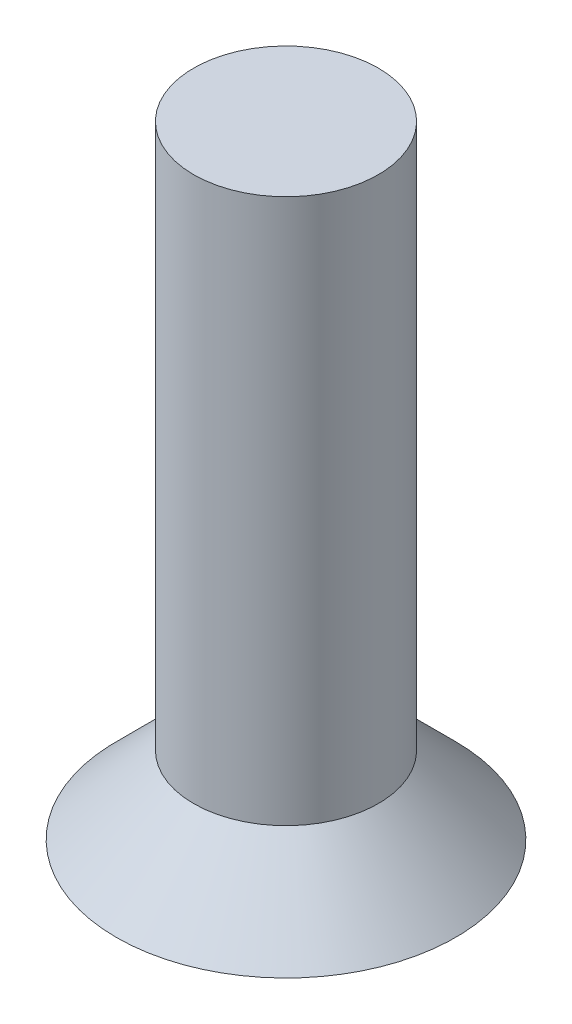
ISO-10303-21;
HEADER;
FILE_DESCRIPTION(('STEP AP214'),'2;1');
FILE_NAME('part.step','',(''),(''),'','','');
FILE_SCHEMA(('AUTOMOTIVE_DESIGN { 1 0 10303 214 1 1 1 1 }'));
ENDSEC;
DATA;
#1=APPLICATION_CONTEXT('core data for automotive mechanical design processes');
#2=APPLICATION_PROTOCOL_DEFINITION('international standard','automotive_design',2000,#1);
#3=PRODUCT_CONTEXT('',#1,'mechanical');
#4=PRODUCT('Part','Part','',(#3));
#5=PRODUCT_RELATED_PRODUCT_CATEGORY('part','',(#4));
#6=PRODUCT_DEFINITION_FORMATION('','',#4);
#7=PRODUCT_DEFINITION_CONTEXT('part definition',#1,'design');
#8=PRODUCT_DEFINITION('design','',#6,#7);
#9=PRODUCT_DEFINITION_SHAPE('','',#8);
#10=(LENGTH_UNIT() NAMED_UNIT(*) SI_UNIT(.MILLI.,.METRE.));
#11=(NAMED_UNIT(*) PLANE_ANGLE_UNIT() SI_UNIT($,.RADIAN.));
#12=(NAMED_UNIT(*) SI_UNIT($,.STERADIAN.) SOLID_ANGLE_UNIT());
#13=UNCERTAINTY_MEASURE_WITH_UNIT(LENGTH_MEASURE(1.E-05),#10,'distance_accuracy_value','');
#14=(GEOMETRIC_REPRESENTATION_CONTEXT(3) GLOBAL_UNCERTAINTY_ASSIGNED_CONTEXT((#13)) GLOBAL_UNIT_ASSIGNED_CONTEXT((#10,
#11,#12)) REPRESENTATION_CONTEXT('',''));
#15=CARTESIAN_POINT('',(0.,0.,0.));
#16=DIRECTION('',(0.,0.,1.));
#17=DIRECTION('',(1.,0.,0.));
#18=AXIS2_PLACEMENT_3D('',#15,#16,#17);
#19=CARTESIAN_POINT('',(0.,0.,0.));
#20=DIRECTION('',(0.,1.,0.));
#21=DIRECTION('',(0.,0.,1.));
#22=AXIS2_PLACEMENT_3D('',#19,#20,#21);
#23=PLANE('',#22);
#24=DIRECTION('',(0.866025403784438,0.,0.500000000000001));
#25=VECTOR('',#24,1.);
#26=CARTESIAN_POINT('',(0.,0.,-1.66247090152183));
#27=LINE('',#26,#25);
#28=CARTESIAN_POINT('',(0.,0.,-1.66247090152183));
#29=VERTEX_POINT('',#28);
#30=CARTESIAN_POINT('',(1.43974203377032,0.,-0.831235450760911));
#31=VERTEX_POINT('',#30);
#32=EDGE_CURVE('E128',#29,#31,#27,.T.);
#33=ORIENTED_EDGE('',*,*,#32,.F.);
#34=DIRECTION('',(0.866025403784441,0.,-0.499999999999995));
#35=VECTOR('',#34,1.);
#36=CARTESIAN_POINT('',(-1.43974203377031,0.,-0.831235450760931));
#37=LINE('',#36,#35);
#38=CARTESIAN_POINT('',(-1.43974203377031,0.,-0.831235450760931));
#39=VERTEX_POINT('',#38);
#40=EDGE_CURVE('E54',#39,#29,#37,.T.);
#41=ORIENTED_EDGE('',*,*,#40,.F.);
#42=DIRECTION('',(0.,0.,-1.));
#43=VECTOR('',#42,1.);
#44=CARTESIAN_POINT('',(-1.43974203377033,0.,0.831235450760901));
#45=LINE('',#44,#43);
#46=CARTESIAN_POINT('',(-1.43974203377033,0.,0.831235450760901));
#47=VERTEX_POINT('',#46);
#48=EDGE_CURVE('E137',#47,#39,#45,.T.);
#49=ORIENTED_EDGE('',*,*,#48,.F.);
#50=DIRECTION('',(-0.866025403784434,0.,-0.500000000000007));
#51=VECTOR('',#50,1.);
#52=CARTESIAN_POINT('',(0.,0.,1.66247090152183));
#53=LINE('',#52,#51);
#54=CARTESIAN_POINT('',(0.,0.,1.66247090152183));
#55=VERTEX_POINT('',#54);
#56=EDGE_CURVE('E135',#55,#47,#53,.T.);
#57=ORIENTED_EDGE('',*,*,#56,.F.);
#58=DIRECTION('',(-0.866025403784442,0.,0.499999999999995));
#59=VECTOR('',#58,1.);
#60=CARTESIAN_POINT('',(1.43974203377032,0.,0.831235450760921));
#61=LINE('',#60,#59);
#62=CARTESIAN_POINT('',(1.43974203377032,0.,0.831235450760921));
#63=VERTEX_POINT('',#62);
#64=EDGE_CURVE('E102',#63,#55,#61,.T.);
#65=ORIENTED_EDGE('',*,*,#64,.F.);
#66=DIRECTION('',(0.,0.,1.));
#67=VECTOR('',#66,1.);
#68=CARTESIAN_POINT('',(1.43974203377032,0.,-0.831235450760911));
#69=LINE('',#68,#67);
#70=EDGE_CURVE('E131',#31,#63,#69,.T.);
#71=ORIENTED_EDGE('',*,*,#70,.F.);
#72=EDGE_LOOP('',(#33,#41,#49,#57,#65,#71));
#73=FACE_BOUND('',#72,.T.);
#74=CARTESIAN_POINT('',(0.,0.,0.));
#75=DIRECTION('',(0.,1.,0.));
#76=DIRECTION('',(0.,0.,1.));
#77=AXIS2_PLACEMENT_3D('',#74,#75,#76);
#78=CIRCLE('',#77,4.5);
#79=CARTESIAN_POINT('',(0.,0.,4.5));
#80=VERTEX_POINT('',#79);
#81=EDGE_CURVE('E47',#80,#80,#78,.T.);
#82=ORIENTED_EDGE('',*,*,#81,.F.);
#83=EDGE_LOOP('',(#82));
#84=FACE_BOUND('',#83,.T.);
#85=ADVANCED_FACE('F38',(#73,#84),#23,.F.);
#86=CARTESIAN_POINT('',(0.,16.5,0.));
#87=DIRECTION('',(0.,-1.,0.));
#88=DIRECTION('',(0.,0.,-1.));
#89=AXIS2_PLACEMENT_3D('',#86,#87,#88);
#90=CYLINDRICAL_SURFACE('',#89,2.45);
#91=CARTESIAN_POINT('',(0.,2.04999999999996,0.));
#92=DIRECTION('',(0.,-1.,0.));
#93=DIRECTION('',(0.,0.,-1.));
#94=AXIS2_PLACEMENT_3D('',#91,#92,#93);
#95=CIRCLE('',#94,2.45);
#96=CARTESIAN_POINT('',(0.,2.04999999999996,-2.45));
#97=VERTEX_POINT('',#96);
#98=EDGE_CURVE('E11',#97,#97,#95,.F.);
#99=ORIENTED_EDGE('',*,*,#98,.T.);
#100=EDGE_LOOP('',(#99));
#101=FACE_BOUND('',#100,.T.);
#102=CARTESIAN_POINT('',(0.,16.5,0.));
#103=DIRECTION('',(0.,1.,0.));
#104=DIRECTION('',(0.,0.,1.));
#105=AXIS2_PLACEMENT_3D('',#102,#103,#104);
#106=CIRCLE('',#105,2.45);
#107=CARTESIAN_POINT('',(0.,16.5,2.45));
#108=VERTEX_POINT('',#107);
#109=EDGE_CURVE('E141',#108,#108,#106,.T.);
#110=ORIENTED_EDGE('',*,*,#109,.F.);
#111=EDGE_LOOP('',(#110));
#112=FACE_BOUND('',#111,.T.);
#113=ADVANCED_FACE('F154',(#101,#112),#90,.T.);
#114=CARTESIAN_POINT('',(0.,16.5,0.));
#115=DIRECTION('',(0.,1.,0.));
#116=DIRECTION('',(0.,0.,1.));
#117=AXIS2_PLACEMENT_3D('',#114,#115,#116);
#118=PLANE('',#117);
#119=ORIENTED_EDGE('',*,*,#109,.T.);
#120=EDGE_LOOP('',(#119));
#121=FACE_BOUND('',#120,.T.);
#122=ADVANCED_FACE('F159',(#121),#118,.T.);
#123=CARTESIAN_POINT('',(0.,2.5,0.));
#124=DIRECTION('',(0.,-1.,0.));
#125=DIRECTION('',(0.,0.,-1.));
#126=AXIS2_PLACEMENT_3D('',#123,#124,#125);
#127=CONICAL_SURFACE('',#126,1.99999999999996,0.785398163397453);
#128=ORIENTED_EDGE('',*,*,#81,.T.);
#129=EDGE_LOOP('',(#128));
#130=FACE_BOUND('',#129,.T.);
#131=ORIENTED_EDGE('',*,*,#98,.F.);
#132=EDGE_LOOP('',(#131));
#133=FACE_BOUND('',#132,.T.);
#134=ADVANCED_FACE('F41',(#130,#133),#127,.T.);
#135=CARTESIAN_POINT('',(-1.43974203377031,1.5,-0.831235450760931));
#136=DIRECTION('',(-0.499999999999995,0.,-0.866025403784441));
#137=DIRECTION('',(-0.866025403784441,0.,0.499999999999995));
#138=AXIS2_PLACEMENT_3D('',#135,#136,#137);
#139=PLANE('',#138);
#140=ORIENTED_EDGE('',*,*,#40,.T.);
#141=DIRECTION('',(0.,-1.,0.));
#142=VECTOR('',#141,1.);
#143=CARTESIAN_POINT('',(0.,1.5,-1.66247090152183));
#144=LINE('',#143,#142);
#145=CARTESIAN_POINT('',(0.,1.5,-1.66247090152183));
#146=VERTEX_POINT('',#145);
#147=EDGE_CURVE('E84',#146,#29,#144,.T.);
#148=ORIENTED_EDGE('',*,*,#147,.F.);
#149=DIRECTION('',(0.866025403784441,0.,-0.499999999999995));
#150=VECTOR('',#149,1.);
#151=CARTESIAN_POINT('',(-1.43974203377031,1.5,-0.831235450760931));
#152=LINE('',#151,#150);
#153=CARTESIAN_POINT('',(-1.43974203377031,1.5,-0.831235450760931));
#154=VERTEX_POINT('',#153);
#155=EDGE_CURVE('E139',#154,#146,#152,.T.);
#156=ORIENTED_EDGE('',*,*,#155,.F.);
#157=DIRECTION('',(0.,-1.,0.));
#158=VECTOR('',#157,1.);
#159=CARTESIAN_POINT('',(-1.43974203377031,1.5,-0.831235450760931));
#160=LINE('',#159,#158);
#161=EDGE_CURVE('E62',#154,#39,#160,.T.);
#162=ORIENTED_EDGE('',*,*,#161,.T.);
#163=EDGE_LOOP('',(#140,#148,#156,#162));
#164=FACE_BOUND('',#163,.T.);
#165=ADVANCED_FACE('F167',(#164),#139,.F.);
#166=CARTESIAN_POINT('',(-1.43974203377033,1.5,0.831235450760901));
#167=DIRECTION('',(-1.,0.,0.));
#168=DIRECTION('',(0.,0.,1.));
#169=AXIS2_PLACEMENT_3D('',#166,#167,#168);
#170=PLANE('',#169);
#171=ORIENTED_EDGE('',*,*,#48,.T.);
#172=ORIENTED_EDGE('',*,*,#161,.F.);
#173=DIRECTION('',(0.,0.,-1.));
#174=VECTOR('',#173,1.);
#175=CARTESIAN_POINT('',(-1.43974203377033,1.5,0.831235450760901));
#176=LINE('',#175,#174);
#177=CARTESIAN_POINT('',(-1.43974203377033,1.5,0.831235450760901));
#178=VERTEX_POINT('',#177);
#179=EDGE_CURVE('E114',#178,#154,#176,.T.);
#180=ORIENTED_EDGE('',*,*,#179,.F.);
#181=DIRECTION('',(0.,-1.,0.));
#182=VECTOR('',#181,1.);
#183=CARTESIAN_POINT('',(-1.43974203377033,1.5,0.831235450760901));
#184=LINE('',#183,#182);
#185=EDGE_CURVE('E106',#178,#47,#184,.T.);
#186=ORIENTED_EDGE('',*,*,#185,.T.);
#187=EDGE_LOOP('',(#171,#172,#180,#186));
#188=FACE_BOUND('',#187,.T.);
#189=ADVANCED_FACE('F170',(#188),#170,.F.);
#190=CARTESIAN_POINT('',(0.,1.5,1.66247090152183));
#191=DIRECTION('',(-0.500000000000007,0.,0.866025403784435));
#192=DIRECTION('',(0.866025403784434,0.,0.500000000000007));
#193=AXIS2_PLACEMENT_3D('',#190,#191,#192);
#194=PLANE('',#193);
#195=ORIENTED_EDGE('',*,*,#56,.T.);
#196=ORIENTED_EDGE('',*,*,#185,.F.);
#197=DIRECTION('',(-0.866025403784434,0.,-0.500000000000007));
#198=VECTOR('',#197,1.);
#199=CARTESIAN_POINT('',(0.,1.5,1.66247090152183));
#200=LINE('',#199,#198);
#201=CARTESIAN_POINT('',(0.,1.5,1.66247090152183));
#202=VERTEX_POINT('',#201);
#203=EDGE_CURVE('E110',#202,#178,#200,.T.);
#204=ORIENTED_EDGE('',*,*,#203,.F.);
#205=DIRECTION('',(0.,-1.,0.));
#206=VECTOR('',#205,1.);
#207=CARTESIAN_POINT('',(0.,1.5,1.66247090152183));
#208=LINE('',#207,#206);
#209=EDGE_CURVE('E95',#202,#55,#208,.T.);
#210=ORIENTED_EDGE('',*,*,#209,.T.);
#211=EDGE_LOOP('',(#195,#196,#204,#210));
#212=FACE_BOUND('',#211,.T.);
#213=ADVANCED_FACE('F111',(#212),#194,.F.);
#214=CARTESIAN_POINT('',(1.43974203377032,1.5,0.831235450760921));
#215=DIRECTION('',(0.499999999999995,0.,0.866025403784441));
#216=DIRECTION('',(0.866025403784442,0.,-0.499999999999995));
#217=AXIS2_PLACEMENT_3D('',#214,#215,#216);
#218=PLANE('',#217);
#219=ORIENTED_EDGE('',*,*,#64,.T.);
#220=ORIENTED_EDGE('',*,*,#209,.F.);
#221=DIRECTION('',(-0.866025403784442,0.,0.499999999999995));
#222=VECTOR('',#221,1.);
#223=CARTESIAN_POINT('',(1.43974203377032,1.5,0.831235450760921));
#224=LINE('',#223,#222);
#225=CARTESIAN_POINT('',(1.43974203377032,1.5,0.831235450760921));
#226=VERTEX_POINT('',#225);
#227=EDGE_CURVE('E99',#226,#202,#224,.T.);
#228=ORIENTED_EDGE('',*,*,#227,.F.);
#229=DIRECTION('',(0.,-1.,0.));
#230=VECTOR('',#229,1.);
#231=CARTESIAN_POINT('',(1.43974203377032,1.5,0.831235450760921));
#232=LINE('',#231,#230);
#233=EDGE_CURVE('E107',#226,#63,#232,.T.);
#234=ORIENTED_EDGE('',*,*,#233,.T.);
#235=EDGE_LOOP('',(#219,#220,#228,#234));
#236=FACE_BOUND('',#235,.T.);
#237=ADVANCED_FACE('F97',(#236),#218,.F.);
#238=CARTESIAN_POINT('',(1.43974203377032,1.5,-0.831235450760911));
#239=DIRECTION('',(1.,0.,0.));
#240=DIRECTION('',(0.,0.,-1.));
#241=AXIS2_PLACEMENT_3D('',#238,#239,#240);
#242=PLANE('',#241);
#243=ORIENTED_EDGE('',*,*,#70,.T.);
#244=ORIENTED_EDGE('',*,*,#233,.F.);
#245=DIRECTION('',(0.,0.,1.));
#246=VECTOR('',#245,1.);
#247=CARTESIAN_POINT('',(1.43974203377032,1.5,-0.831235450760911));
#248=LINE('',#247,#246);
#249=CARTESIAN_POINT('',(1.43974203377032,1.5,-0.831235450760911));
#250=VERTEX_POINT('',#249);
#251=EDGE_CURVE('E120',#250,#226,#248,.T.);
#252=ORIENTED_EDGE('',*,*,#251,.F.);
#253=DIRECTION('',(0.,-1.,0.));
#254=VECTOR('',#253,1.);
#255=CARTESIAN_POINT('',(1.43974203377032,1.5,-0.831235450760911));
#256=LINE('',#255,#254);
#257=EDGE_CURVE('E144',#250,#31,#256,.T.);
#258=ORIENTED_EDGE('',*,*,#257,.T.);
#259=EDGE_LOOP('',(#243,#244,#252,#258));
#260=FACE_BOUND('',#259,.T.);
#261=ADVANCED_FACE('F174',(#260),#242,.F.);
#262=CARTESIAN_POINT('',(0.,1.5,-1.66247090152183));
#263=DIRECTION('',(0.500000000000001,0.,-0.866025403784438));
#264=DIRECTION('',(-0.866025403784438,0.,-0.500000000000001));
#265=AXIS2_PLACEMENT_3D('',#262,#263,#264);
#266=PLANE('',#265);
#267=ORIENTED_EDGE('',*,*,#32,.T.);
#268=ORIENTED_EDGE('',*,*,#257,.F.);
#269=DIRECTION('',(0.866025403784438,0.,0.500000000000001));
#270=VECTOR('',#269,1.);
#271=CARTESIAN_POINT('',(0.,1.5,-1.66247090152183));
#272=LINE('',#271,#270);
#273=EDGE_CURVE('E122',#146,#250,#272,.T.);
#274=ORIENTED_EDGE('',*,*,#273,.F.);
#275=ORIENTED_EDGE('',*,*,#147,.T.);
#276=EDGE_LOOP('',(#267,#268,#274,#275));
#277=FACE_BOUND('',#276,.T.);
#278=ADVANCED_FACE('F171',(#277),#266,.F.);
#279=CARTESIAN_POINT('',(0.,1.5,0.));
#280=DIRECTION('',(0.,-1.,0.));
#281=DIRECTION('',(0.,0.,-1.));
#282=AXIS2_PLACEMENT_3D('',#279,#280,#281);
#283=PLANE('',#282);
#284=ORIENTED_EDGE('',*,*,#155,.T.);
#285=ORIENTED_EDGE('',*,*,#273,.T.);
#286=ORIENTED_EDGE('',*,*,#251,.T.);
#287=ORIENTED_EDGE('',*,*,#227,.T.);
#288=ORIENTED_EDGE('',*,*,#203,.T.);
#289=ORIENTED_EDGE('',*,*,#179,.T.);
#290=EDGE_LOOP('',(#284,#285,#286,#287,#288,#289));
#291=FACE_BOUND('',#290,.T.);
#292=ADVANCED_FACE('F117',(#291),#283,.T.);
#293=CLOSED_SHELL('',(#85,#113,#122,#134,#165,#189,#213,#237,#261,#278,#292));
#294=MANIFOLD_SOLID_BREP('B2',#293);
#295=ADVANCED_BREP_SHAPE_REPRESENTATION('',(#18,#294),#14);
#296=SHAPE_DEFINITION_REPRESENTATION(#9,#295);
ENDSEC;
END-ISO-10303-21;
